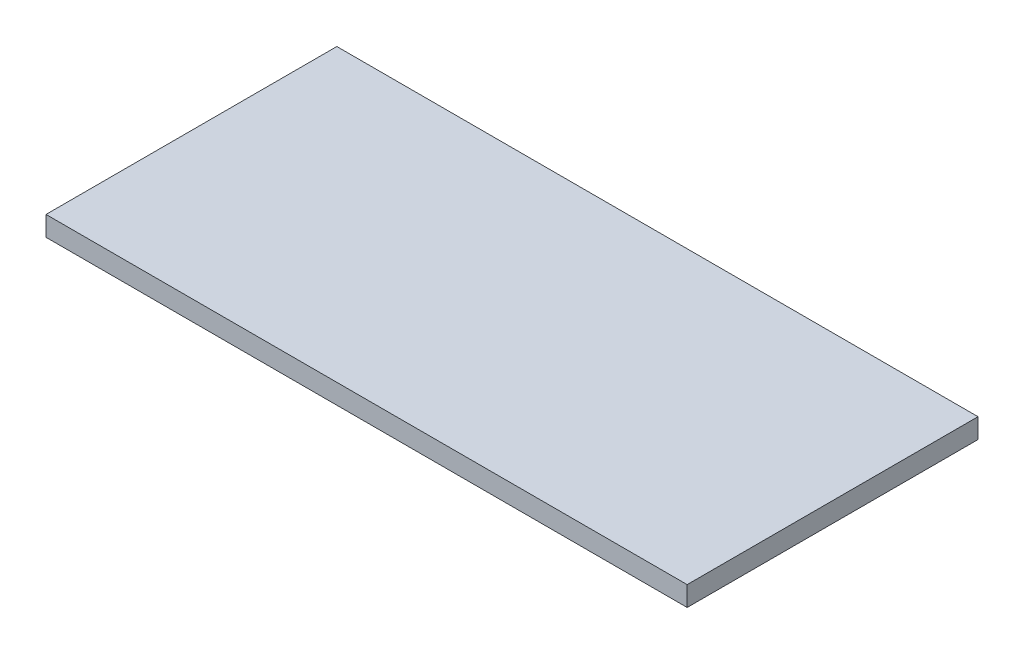
ISO-10303-21;
HEADER;
FILE_DESCRIPTION(('STEP AP214'),'2;1');
FILE_NAME('part.step','',(''),(''),'','','');
FILE_SCHEMA(('AUTOMOTIVE_DESIGN { 1 0 10303 214 1 1 1 1 }'));
ENDSEC;
DATA;
#1=APPLICATION_CONTEXT('core data for automotive mechanical design processes');
#2=APPLICATION_PROTOCOL_DEFINITION('international standard','automotive_design',2000,#1);
#3=PRODUCT_CONTEXT('',#1,'mechanical');
#4=PRODUCT('Part','Part','',(#3));
#5=PRODUCT_RELATED_PRODUCT_CATEGORY('part','',(#4));
#6=PRODUCT_DEFINITION_FORMATION('','',#4);
#7=PRODUCT_DEFINITION_CONTEXT('part definition',#1,'design');
#8=PRODUCT_DEFINITION('design','',#6,#7);
#9=PRODUCT_DEFINITION_SHAPE('','',#8);
#10=(LENGTH_UNIT() NAMED_UNIT(*) SI_UNIT(.MILLI.,.METRE.));
#11=(NAMED_UNIT(*) PLANE_ANGLE_UNIT() SI_UNIT($,.RADIAN.));
#12=(NAMED_UNIT(*) SI_UNIT($,.STERADIAN.) SOLID_ANGLE_UNIT());
#13=UNCERTAINTY_MEASURE_WITH_UNIT(LENGTH_MEASURE(1.E-05),#10,'distance_accuracy_value','');
#14=(GEOMETRIC_REPRESENTATION_CONTEXT(3) GLOBAL_UNCERTAINTY_ASSIGNED_CONTEXT((#13)) GLOBAL_UNIT_ASSIGNED_CONTEXT((#10,
#11,#12)) REPRESENTATION_CONTEXT('',''));
#15=CARTESIAN_POINT('',(0.,0.,0.));
#16=DIRECTION('',(0.,0.,1.));
#17=DIRECTION('',(1.,0.,0.));
#18=AXIS2_PLACEMENT_3D('',#15,#16,#17);
#19=CARTESIAN_POINT('',(-48.5,3.,-22.));
#20=DIRECTION('',(1.,0.,0.));
#21=DIRECTION('',(0.,0.,-1.));
#22=AXIS2_PLACEMENT_3D('',#19,#20,#21);
#23=PLANE('',#22);
#24=DIRECTION('',(0.,0.,1.));
#25=VECTOR('',#24,1.);
#26=CARTESIAN_POINT('',(-48.5,0.,-22.));
#27=LINE('',#26,#25);
#28=CARTESIAN_POINT('',(-48.5,0.,-22.));
#29=VERTEX_POINT('',#28);
#30=CARTESIAN_POINT('',(-48.5,0.,22.));
#31=VERTEX_POINT('',#30);
#32=EDGE_CURVE('E96',#29,#31,#27,.T.);
#33=ORIENTED_EDGE('',*,*,#32,.T.);
#34=DIRECTION('',(0.,-1.,0.));
#35=VECTOR('',#34,1.);
#36=CARTESIAN_POINT('',(-48.5,3.,22.));
#37=LINE('',#36,#35);
#38=CARTESIAN_POINT('',(-48.5,3.,22.));
#39=VERTEX_POINT('',#38);
#40=EDGE_CURVE('E11',#39,#31,#37,.T.);
#41=ORIENTED_EDGE('',*,*,#40,.F.);
#42=DIRECTION('',(0.,0.,1.));
#43=VECTOR('',#42,1.);
#44=CARTESIAN_POINT('',(-48.5,3.,-22.));
#45=LINE('',#44,#43);
#46=CARTESIAN_POINT('',(-48.5,3.,-22.));
#47=VERTEX_POINT('',#46);
#48=EDGE_CURVE('E84',#47,#39,#45,.T.);
#49=ORIENTED_EDGE('',*,*,#48,.F.);
#50=DIRECTION('',(0.,-1.,0.));
#51=VECTOR('',#50,1.);
#52=CARTESIAN_POINT('',(-48.5,3.,-22.));
#53=LINE('',#52,#51);
#54=EDGE_CURVE('E92',#47,#29,#53,.T.);
#55=ORIENTED_EDGE('',*,*,#54,.T.);
#56=EDGE_LOOP('',(#33,#41,#49,#55));
#57=FACE_BOUND('',#56,.T.);
#58=ADVANCED_FACE('F33',(#57),#23,.F.);
#59=CARTESIAN_POINT('',(-48.5,3.,22.));
#60=DIRECTION('',(0.,0.,-1.));
#61=DIRECTION('',(-1.,0.,0.));
#62=AXIS2_PLACEMENT_3D('',#59,#60,#61);
#63=PLANE('',#62);
#64=DIRECTION('',(1.,0.,0.));
#65=VECTOR('',#64,1.);
#66=CARTESIAN_POINT('',(-48.5,0.,22.));
#67=LINE('',#66,#65);
#68=CARTESIAN_POINT('',(48.5,0.,22.));
#69=VERTEX_POINT('',#68);
#70=EDGE_CURVE('E88',#31,#69,#67,.T.);
#71=ORIENTED_EDGE('',*,*,#70,.T.);
#72=DIRECTION('',(0.,-1.,0.));
#73=VECTOR('',#72,1.);
#74=CARTESIAN_POINT('',(48.5,3.,22.));
#75=LINE('',#74,#73);
#76=CARTESIAN_POINT('',(48.5,3.,22.));
#77=VERTEX_POINT('',#76);
#78=EDGE_CURVE('E41',#77,#69,#75,.T.);
#79=ORIENTED_EDGE('',*,*,#78,.F.);
#80=DIRECTION('',(1.,0.,0.));
#81=VECTOR('',#80,1.);
#82=CARTESIAN_POINT('',(-48.5,3.,22.));
#83=LINE('',#82,#81);
#84=EDGE_CURVE('E79',#39,#77,#83,.T.);
#85=ORIENTED_EDGE('',*,*,#84,.F.);
#86=ORIENTED_EDGE('',*,*,#40,.T.);
#87=EDGE_LOOP('',(#71,#79,#85,#86));
#88=FACE_BOUND('',#87,.T.);
#89=ADVANCED_FACE('F87',(#88),#63,.F.);
#90=CARTESIAN_POINT('',(48.5,3.,-22.));
#91=DIRECTION('',(-1.,0.,0.));
#92=DIRECTION('',(0.,0.,1.));
#93=AXIS2_PLACEMENT_3D('',#90,#91,#92);
#94=PLANE('',#93);
#95=DIRECTION('',(0.,0.,-1.));
#96=VECTOR('',#95,1.);
#97=CARTESIAN_POINT('',(48.5,0.,-22.));
#98=LINE('',#97,#96);
#99=CARTESIAN_POINT('',(48.5,0.,-22.));
#100=VERTEX_POINT('',#99);
#101=EDGE_CURVE('E66',#69,#100,#98,.T.);
#102=ORIENTED_EDGE('',*,*,#101,.T.);
#103=DIRECTION('',(0.,-1.,0.));
#104=VECTOR('',#103,1.);
#105=CARTESIAN_POINT('',(48.5,3.,-22.));
#106=LINE('',#105,#104);
#107=CARTESIAN_POINT('',(48.5,3.,-22.));
#108=VERTEX_POINT('',#107);
#109=EDGE_CURVE('E89',#108,#100,#106,.T.);
#110=ORIENTED_EDGE('',*,*,#109,.F.);
#111=DIRECTION('',(0.,0.,-1.));
#112=VECTOR('',#111,1.);
#113=CARTESIAN_POINT('',(48.5,3.,-22.));
#114=LINE('',#113,#112);
#115=EDGE_CURVE('E82',#77,#108,#114,.T.);
#116=ORIENTED_EDGE('',*,*,#115,.F.);
#117=ORIENTED_EDGE('',*,*,#78,.T.);
#118=EDGE_LOOP('',(#102,#110,#116,#117));
#119=FACE_BOUND('',#118,.T.);
#120=ADVANCED_FACE('F90',(#119),#94,.F.);
#121=CARTESIAN_POINT('',(-48.5,3.,-22.));
#122=DIRECTION('',(0.,0.,1.));
#123=DIRECTION('',(1.,0.,0.));
#124=AXIS2_PLACEMENT_3D('',#121,#122,#123);
#125=PLANE('',#124);
#126=DIRECTION('',(-1.,0.,0.));
#127=VECTOR('',#126,1.);
#128=CARTESIAN_POINT('',(-48.5,0.,-22.));
#129=LINE('',#128,#127);
#130=EDGE_CURVE('E72',#100,#29,#129,.T.);
#131=ORIENTED_EDGE('',*,*,#130,.T.);
#132=ORIENTED_EDGE('',*,*,#54,.F.);
#133=DIRECTION('',(-1.,0.,0.));
#134=VECTOR('',#133,1.);
#135=CARTESIAN_POINT('',(-48.5,3.,-22.));
#136=LINE('',#135,#134);
#137=EDGE_CURVE('E49',#108,#47,#136,.T.);
#138=ORIENTED_EDGE('',*,*,#137,.F.);
#139=ORIENTED_EDGE('',*,*,#109,.T.);
#140=EDGE_LOOP('',(#131,#132,#138,#139));
#141=FACE_BOUND('',#140,.T.);
#142=ADVANCED_FACE('F103',(#141),#125,.F.);
#143=CARTESIAN_POINT('',(0.,3.,0.));
#144=DIRECTION('',(0.,1.,0.));
#145=DIRECTION('',(0.,0.,1.));
#146=AXIS2_PLACEMENT_3D('',#143,#144,#145);
#147=PLANE('',#146);
#148=ORIENTED_EDGE('',*,*,#48,.T.);
#149=ORIENTED_EDGE('',*,*,#84,.T.);
#150=ORIENTED_EDGE('',*,*,#115,.T.);
#151=ORIENTED_EDGE('',*,*,#137,.T.);
#152=EDGE_LOOP('',(#148,#149,#150,#151));
#153=FACE_BOUND('',#152,.T.);
#154=ADVANCED_FACE('F80',(#153),#147,.T.);
#155=CARTESIAN_POINT('',(0.,0.,0.));
#156=DIRECTION('',(0.,1.,0.));
#157=DIRECTION('',(0.,0.,1.));
#158=AXIS2_PLACEMENT_3D('',#155,#156,#157);
#159=PLANE('',#158);
#160=ORIENTED_EDGE('',*,*,#32,.F.);
#161=ORIENTED_EDGE('',*,*,#130,.F.);
#162=ORIENTED_EDGE('',*,*,#101,.F.);
#163=ORIENTED_EDGE('',*,*,#70,.F.);
#164=EDGE_LOOP('',(#160,#161,#162,#163));
#165=FACE_BOUND('',#164,.T.);
#166=ADVANCED_FACE('F106',(#165),#159,.F.);
#167=CLOSED_SHELL('',(#58,#89,#120,#142,#154,#166));
#168=MANIFOLD_SOLID_BREP('B2',#167);
#169=ADVANCED_BREP_SHAPE_REPRESENTATION('',(#18,#168),#14);
#170=SHAPE_DEFINITION_REPRESENTATION(#9,#169);
ENDSEC;
END-ISO-10303-21;
